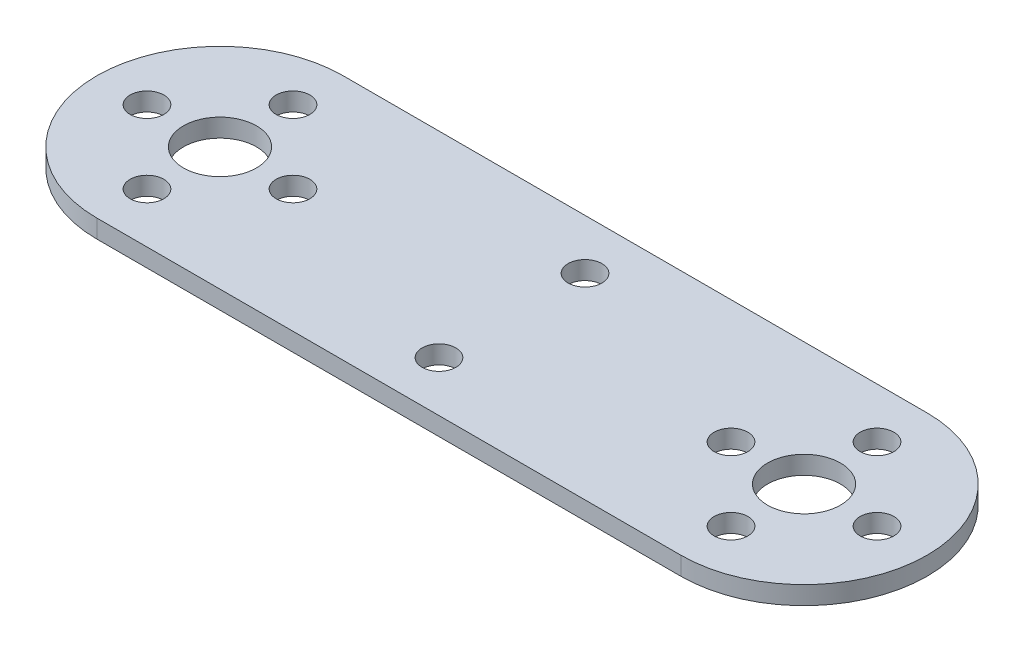
ISO-10303-21;
HEADER;
FILE_DESCRIPTION(('STEP AP214'),'2;1');
FILE_NAME('part.step','',(''),(''),'','','');
FILE_SCHEMA(('AUTOMOTIVE_DESIGN { 1 0 10303 214 1 1 1 1 }'));
ENDSEC;
DATA;
#1=APPLICATION_CONTEXT('core data for automotive mechanical design processes');
#2=APPLICATION_PROTOCOL_DEFINITION('international standard','automotive_design',2000,#1);
#3=PRODUCT_CONTEXT('',#1,'mechanical');
#4=PRODUCT('Part','Part','',(#3));
#5=PRODUCT_RELATED_PRODUCT_CATEGORY('part','',(#4));
#6=PRODUCT_DEFINITION_FORMATION('','',#4);
#7=PRODUCT_DEFINITION_CONTEXT('part definition',#1,'design');
#8=PRODUCT_DEFINITION('design','',#6,#7);
#9=PRODUCT_DEFINITION_SHAPE('','',#8);
#10=(LENGTH_UNIT() NAMED_UNIT(*) SI_UNIT(.MILLI.,.METRE.));
#11=(NAMED_UNIT(*) PLANE_ANGLE_UNIT() SI_UNIT($,.RADIAN.));
#12=(NAMED_UNIT(*) SI_UNIT($,.STERADIAN.) SOLID_ANGLE_UNIT());
#13=UNCERTAINTY_MEASURE_WITH_UNIT(LENGTH_MEASURE(1.E-05),#10,'distance_accuracy_value','');
#14=(GEOMETRIC_REPRESENTATION_CONTEXT(3) GLOBAL_UNCERTAINTY_ASSIGNED_CONTEXT((#13)) GLOBAL_UNIT_ASSIGNED_CONTEXT((#10,
#11,#12)) REPRESENTATION_CONTEXT('',''));
#15=CARTESIAN_POINT('',(0.,0.,0.));
#16=DIRECTION('',(0.,0.,1.));
#17=DIRECTION('',(1.,0.,0.));
#18=AXIS2_PLACEMENT_3D('',#15,#16,#17);
#19=CARTESIAN_POINT('',(0.,2.,0.));
#20=DIRECTION('',(0.,1.,0.));
#21=DIRECTION('',(0.,0.,1.));
#22=AXIS2_PLACEMENT_3D('',#19,#20,#21);
#23=PLANE('',#22);
#24=CARTESIAN_POINT('',(32.,2.,8.));
#25=DIRECTION('',(0.,1.,0.));
#26=DIRECTION('',(0.,0.,1.));
#27=AXIS2_PLACEMENT_3D('',#24,#25,#26);
#28=CIRCLE('',#27,1.85);
#29=CARTESIAN_POINT('',(32.,2.,9.85));
#30=VERTEX_POINT('',#29);
#31=EDGE_CURVE('E175',#30,#30,#28,.T.);
#32=ORIENTED_EDGE('',*,*,#31,.F.);
#33=EDGE_LOOP('',(#32));
#34=FACE_BOUND('',#33,.T.);
#35=CARTESIAN_POINT('',(32.,2.,-8.));
#36=DIRECTION('',(0.,1.,0.));
#37=DIRECTION('',(0.,0.,1.));
#38=AXIS2_PLACEMENT_3D('',#35,#36,#37);
#39=CIRCLE('',#38,1.85);
#40=CARTESIAN_POINT('',(32.,2.,-6.15));
#41=VERTEX_POINT('',#40);
#42=EDGE_CURVE('E169',#41,#41,#39,.T.);
#43=ORIENTED_EDGE('',*,*,#42,.F.);
#44=EDGE_LOOP('',(#43));
#45=FACE_BOUND('',#44,.T.);
#46=CARTESIAN_POINT('',(56.,2.,0.));
#47=DIRECTION('',(0.,1.,0.));
#48=DIRECTION('',(0.,0.,1.));
#49=AXIS2_PLACEMENT_3D('',#46,#47,#48);
#50=CIRCLE('',#49,1.85);
#51=CARTESIAN_POINT('',(56.,2.,1.85));
#52=VERTEX_POINT('',#51);
#53=EDGE_CURVE('E134',#52,#52,#50,.F.);
#54=ORIENTED_EDGE('',*,*,#53,.T.);
#55=EDGE_LOOP('',(#54));
#56=FACE_BOUND('',#55,.T.);
#57=CARTESIAN_POINT('',(64.,2.,8.));
#58=DIRECTION('',(0.,1.,0.));
#59=DIRECTION('',(0.,0.,1.));
#60=AXIS2_PLACEMENT_3D('',#57,#58,#59);
#61=CIRCLE('',#60,1.85);
#62=CARTESIAN_POINT('',(64.,2.,9.85));
#63=VERTEX_POINT('',#62);
#64=EDGE_CURVE('E137',#63,#63,#61,.F.);
#65=ORIENTED_EDGE('',*,*,#64,.T.);
#66=EDGE_LOOP('',(#65));
#67=FACE_BOUND('',#66,.T.);
#68=CARTESIAN_POINT('',(72.,2.,0.));
#69=DIRECTION('',(0.,1.,0.));
#70=DIRECTION('',(0.,0.,1.));
#71=AXIS2_PLACEMENT_3D('',#68,#69,#70);
#72=CIRCLE('',#71,1.85);
#73=CARTESIAN_POINT('',(72.,2.,1.85));
#74=VERTEX_POINT('',#73);
#75=EDGE_CURVE('E140',#74,#74,#72,.F.);
#76=ORIENTED_EDGE('',*,*,#75,.T.);
#77=EDGE_LOOP('',(#76));
#78=FACE_BOUND('',#77,.T.);
#79=CARTESIAN_POINT('',(64.,2.,-8.));
#80=DIRECTION('',(0.,1.,0.));
#81=DIRECTION('',(0.,0.,1.));
#82=AXIS2_PLACEMENT_3D('',#79,#80,#81);
#83=CIRCLE('',#82,1.85);
#84=CARTESIAN_POINT('',(64.,2.,-6.15));
#85=VERTEX_POINT('',#84);
#86=EDGE_CURVE('E143',#85,#85,#83,.F.);
#87=ORIENTED_EDGE('',*,*,#86,.T.);
#88=EDGE_LOOP('',(#87));
#89=FACE_BOUND('',#88,.T.);
#90=CARTESIAN_POINT('',(64.,2.,0.));
#91=DIRECTION('',(0.,1.,0.));
#92=DIRECTION('',(0.,0.,1.));
#93=AXIS2_PLACEMENT_3D('',#90,#91,#92);
#94=CIRCLE('',#93,4.);
#95=CARTESIAN_POINT('',(64.,2.,4.));
#96=VERTEX_POINT('',#95);
#97=EDGE_CURVE('E146',#96,#96,#94,.F.);
#98=ORIENTED_EDGE('',*,*,#97,.T.);
#99=EDGE_LOOP('',(#98));
#100=FACE_BOUND('',#99,.T.);
#101=CARTESIAN_POINT('',(-8.,2.,0.));
#102=DIRECTION('',(0.,1.,0.));
#103=DIRECTION('',(0.,0.,1.));
#104=AXIS2_PLACEMENT_3D('',#101,#102,#103);
#105=CIRCLE('',#104,1.85);
#106=CARTESIAN_POINT('',(-8.,2.,1.85));
#107=VERTEX_POINT('',#106);
#108=EDGE_CURVE('E149',#107,#107,#105,.F.);
#109=ORIENTED_EDGE('',*,*,#108,.T.);
#110=EDGE_LOOP('',(#109));
#111=FACE_BOUND('',#110,.T.);
#112=CARTESIAN_POINT('',(0.,2.,8.));
#113=DIRECTION('',(0.,1.,0.));
#114=DIRECTION('',(0.,0.,1.));
#115=AXIS2_PLACEMENT_3D('',#112,#113,#114);
#116=CIRCLE('',#115,1.85);
#117=CARTESIAN_POINT('',(0.,2.,9.85));
#118=VERTEX_POINT('',#117);
#119=EDGE_CURVE('E152',#118,#118,#116,.F.);
#120=ORIENTED_EDGE('',*,*,#119,.T.);
#121=EDGE_LOOP('',(#120));
#122=FACE_BOUND('',#121,.T.);
#123=CARTESIAN_POINT('',(8.,2.,0.));
#124=DIRECTION('',(0.,1.,0.));
#125=DIRECTION('',(0.,0.,1.));
#126=AXIS2_PLACEMENT_3D('',#123,#124,#125);
#127=CIRCLE('',#126,1.85);
#128=CARTESIAN_POINT('',(8.,2.,1.85));
#129=VERTEX_POINT('',#128);
#130=EDGE_CURVE('E155',#129,#129,#127,.F.);
#131=ORIENTED_EDGE('',*,*,#130,.T.);
#132=EDGE_LOOP('',(#131));
#133=FACE_BOUND('',#132,.T.);
#134=CARTESIAN_POINT('',(0.,2.,-8.));
#135=DIRECTION('',(0.,1.,0.));
#136=DIRECTION('',(0.,0.,1.));
#137=AXIS2_PLACEMENT_3D('',#134,#135,#136);
#138=CIRCLE('',#137,1.85);
#139=CARTESIAN_POINT('',(0.,2.,-6.15));
#140=VERTEX_POINT('',#139);
#141=EDGE_CURVE('E158',#140,#140,#138,.F.);
#142=ORIENTED_EDGE('',*,*,#141,.T.);
#143=EDGE_LOOP('',(#142));
#144=FACE_BOUND('',#143,.T.);
#145=CARTESIAN_POINT('',(0.,2.,0.));
#146=DIRECTION('',(0.,1.,0.));
#147=DIRECTION('',(0.,0.,1.));
#148=AXIS2_PLACEMENT_3D('',#145,#146,#147);
#149=CIRCLE('',#148,4.);
#150=CARTESIAN_POINT('',(0.,2.,4.));
#151=VERTEX_POINT('',#150);
#152=EDGE_CURVE('E161',#151,#151,#149,.F.);
#153=ORIENTED_EDGE('',*,*,#152,.T.);
#154=EDGE_LOOP('',(#153));
#155=FACE_BOUND('',#154,.T.);
#156=CARTESIAN_POINT('',(64.,2.,0.));
#157=DIRECTION('',(0.,1.,0.));
#158=DIRECTION('',(0.,0.,1.));
#159=AXIS2_PLACEMENT_3D('',#156,#157,#158);
#160=CIRCLE('',#159,13.5);
#161=CARTESIAN_POINT('',(64.,2.,-13.5));
#162=VERTEX_POINT('',#161);
#163=CARTESIAN_POINT('',(64.,2.,13.5));
#164=VERTEX_POINT('',#163);
#165=EDGE_CURVE('E40',#162,#164,#160,.F.);
#166=ORIENTED_EDGE('',*,*,#165,.F.);
#167=DIRECTION('',(-1.,0.,0.));
#168=VECTOR('',#167,1.);
#169=CARTESIAN_POINT('',(64.,2.,-13.5));
#170=LINE('',#169,#168);
#171=CARTESIAN_POINT('',(0.,2.,-13.5));
#172=VERTEX_POINT('',#171);
#173=EDGE_CURVE('E74',#172,#162,#170,.F.);
#174=ORIENTED_EDGE('',*,*,#173,.F.);
#175=CARTESIAN_POINT('',(0.,2.,0.));
#176=DIRECTION('',(0.,1.,0.));
#177=DIRECTION('',(0.,0.,1.));
#178=AXIS2_PLACEMENT_3D('',#175,#176,#177);
#179=CIRCLE('',#178,13.5);
#180=CARTESIAN_POINT('',(0.,2.,13.5));
#181=VERTEX_POINT('',#180);
#182=EDGE_CURVE('E89',#181,#172,#179,.F.);
#183=ORIENTED_EDGE('',*,*,#182,.F.);
#184=DIRECTION('',(1.,0.,0.));
#185=VECTOR('',#184,1.);
#186=CARTESIAN_POINT('',(0.,2.,13.5));
#187=LINE('',#186,#185);
#188=EDGE_CURVE('E87',#164,#181,#187,.F.);
#189=ORIENTED_EDGE('',*,*,#188,.F.);
#190=EDGE_LOOP('',(#166,#174,#183,#189));
#191=FACE_BOUND('',#190,.T.);
#192=ADVANCED_FACE('F37',(#34,#45,#56,#67,#78,#89,#100,#111,#122,#133,#144,#155,#191),#23,.T.);
#193=CARTESIAN_POINT('',(0.,0.,13.5));
#194=DIRECTION('',(0.,0.,1.));
#195=DIRECTION('',(1.,0.,0.));
#196=AXIS2_PLACEMENT_3D('',#193,#194,#195);
#197=PLANE('',#196);
#198=ORIENTED_EDGE('',*,*,#188,.T.);
#199=DIRECTION('',(0.,1.,0.));
#200=VECTOR('',#199,1.);
#201=CARTESIAN_POINT('',(0.,0.,13.5));
#202=LINE('',#201,#200);
#203=CARTESIAN_POINT('',(0.,0.,13.5));
#204=VERTEX_POINT('',#203);
#205=EDGE_CURVE('E163',#204,#181,#202,.T.);
#206=ORIENTED_EDGE('',*,*,#205,.F.);
#207=DIRECTION('',(1.,0.,0.));
#208=VECTOR('',#207,1.);
#209=CARTESIAN_POINT('',(0.,0.,13.5));
#210=LINE('',#209,#208);
#211=CARTESIAN_POINT('',(64.,0.,13.5));
#212=VERTEX_POINT('',#211);
#213=EDGE_CURVE('E97',#204,#212,#210,.T.);
#214=ORIENTED_EDGE('',*,*,#213,.T.);
#215=DIRECTION('',(0.,1.,0.));
#216=VECTOR('',#215,1.);
#217=CARTESIAN_POINT('',(64.,0.,13.5));
#218=LINE('',#217,#216);
#219=EDGE_CURVE('E83',#164,#212,#218,.F.);
#220=ORIENTED_EDGE('',*,*,#219,.F.);
#221=EDGE_LOOP('',(#198,#206,#214,#220));
#222=FACE_BOUND('',#221,.T.);
#223=ADVANCED_FACE('F96',(#222),#197,.T.);
#224=CARTESIAN_POINT('',(64.,0.,0.));
#225=DIRECTION('',(0.,1.,0.));
#226=DIRECTION('',(0.,0.,1.));
#227=AXIS2_PLACEMENT_3D('',#224,#225,#226);
#228=CYLINDRICAL_SURFACE('',#227,13.5);
#229=ORIENTED_EDGE('',*,*,#165,.T.);
#230=ORIENTED_EDGE('',*,*,#219,.T.);
#231=CARTESIAN_POINT('',(64.,0.,0.));
#232=DIRECTION('',(0.,1.,0.));
#233=DIRECTION('',(0.,0.,1.));
#234=AXIS2_PLACEMENT_3D('',#231,#232,#233);
#235=CIRCLE('',#234,13.5);
#236=CARTESIAN_POINT('',(64.,0.,-13.5));
#237=VERTEX_POINT('',#236);
#238=EDGE_CURVE('E132',#212,#237,#235,.T.);
#239=ORIENTED_EDGE('',*,*,#238,.T.);
#240=DIRECTION('',(0.,1.,0.));
#241=VECTOR('',#240,1.);
#242=CARTESIAN_POINT('',(64.,0.,-13.5));
#243=LINE('',#242,#241);
#244=EDGE_CURVE('E85',#162,#237,#243,.F.);
#245=ORIENTED_EDGE('',*,*,#244,.F.);
#246=EDGE_LOOP('',(#229,#230,#239,#245));
#247=FACE_BOUND('',#246,.T.);
#248=ADVANCED_FACE('F80',(#247),#228,.T.);
#249=CARTESIAN_POINT('',(64.,0.,-13.5));
#250=DIRECTION('',(0.,0.,-1.));
#251=DIRECTION('',(-1.,0.,0.));
#252=AXIS2_PLACEMENT_3D('',#249,#250,#251);
#253=PLANE('',#252);
#254=ORIENTED_EDGE('',*,*,#173,.T.);
#255=ORIENTED_EDGE('',*,*,#244,.T.);
#256=DIRECTION('',(1.,0.,0.));
#257=VECTOR('',#256,1.);
#258=CARTESIAN_POINT('',(0.,0.,-13.5));
#259=LINE('',#258,#257);
#260=CARTESIAN_POINT('',(0.,0.,-13.5));
#261=VERTEX_POINT('',#260);
#262=EDGE_CURVE('E131',#237,#261,#259,.F.);
#263=ORIENTED_EDGE('',*,*,#262,.T.);
#264=DIRECTION('',(0.,1.,0.));
#265=VECTOR('',#264,1.);
#266=CARTESIAN_POINT('',(0.,0.,-13.5));
#267=LINE('',#266,#265);
#268=EDGE_CURVE('E55',#172,#261,#267,.F.);
#269=ORIENTED_EDGE('',*,*,#268,.F.);
#270=EDGE_LOOP('',(#254,#255,#263,#269));
#271=FACE_BOUND('',#270,.T.);
#272=ADVANCED_FACE('F228',(#271),#253,.T.);
#273=CARTESIAN_POINT('',(0.,0.,0.));
#274=DIRECTION('',(0.,1.,0.));
#275=DIRECTION('',(0.,0.,1.));
#276=AXIS2_PLACEMENT_3D('',#273,#274,#275);
#277=CYLINDRICAL_SURFACE('',#276,13.5);
#278=ORIENTED_EDGE('',*,*,#182,.T.);
#279=ORIENTED_EDGE('',*,*,#268,.T.);
#280=CARTESIAN_POINT('',(0.,0.,0.));
#281=DIRECTION('',(0.,1.,0.));
#282=DIRECTION('',(0.,0.,1.));
#283=AXIS2_PLACEMENT_3D('',#280,#281,#282);
#284=CIRCLE('',#283,13.5);
#285=EDGE_CURVE('E129',#261,#204,#284,.T.);
#286=ORIENTED_EDGE('',*,*,#285,.T.);
#287=ORIENTED_EDGE('',*,*,#205,.T.);
#288=EDGE_LOOP('',(#278,#279,#286,#287));
#289=FACE_BOUND('',#288,.T.);
#290=ADVANCED_FACE('F218',(#289),#277,.T.);
#291=CARTESIAN_POINT('',(0.,0.,0.));
#292=DIRECTION('',(0.,1.,0.));
#293=DIRECTION('',(0.,0.,1.));
#294=AXIS2_PLACEMENT_3D('',#291,#292,#293);
#295=CYLINDRICAL_SURFACE('',#294,4.);
#296=CARTESIAN_POINT('',(0.,0.,0.));
#297=DIRECTION('',(0.,1.,0.));
#298=DIRECTION('',(0.,0.,1.));
#299=AXIS2_PLACEMENT_3D('',#296,#297,#298);
#300=CIRCLE('',#299,4.);
#301=CARTESIAN_POINT('',(0.,0.,4.));
#302=VERTEX_POINT('',#301);
#303=EDGE_CURVE('E126',#302,#302,#300,.F.);
#304=ORIENTED_EDGE('',*,*,#303,.T.);
#305=EDGE_LOOP('',(#304));
#306=FACE_BOUND('',#305,.T.);
#307=ORIENTED_EDGE('',*,*,#152,.F.);
#308=EDGE_LOOP('',(#307));
#309=FACE_BOUND('',#308,.T.);
#310=ADVANCED_FACE('F215',(#306,#309),#295,.F.);
#311=CARTESIAN_POINT('',(0.,0.,-8.));
#312=DIRECTION('',(0.,1.,0.));
#313=DIRECTION('',(0.,0.,1.));
#314=AXIS2_PLACEMENT_3D('',#311,#312,#313);
#315=CYLINDRICAL_SURFACE('',#314,1.85);
#316=CARTESIAN_POINT('',(0.,0.,-8.));
#317=DIRECTION('',(0.,1.,0.));
#318=DIRECTION('',(0.,0.,1.));
#319=AXIS2_PLACEMENT_3D('',#316,#317,#318);
#320=CIRCLE('',#319,1.85);
#321=CARTESIAN_POINT('',(0.,0.,-6.15));
#322=VERTEX_POINT('',#321);
#323=EDGE_CURVE('E123',#322,#322,#320,.F.);
#324=ORIENTED_EDGE('',*,*,#323,.T.);
#325=EDGE_LOOP('',(#324));
#326=FACE_BOUND('',#325,.T.);
#327=ORIENTED_EDGE('',*,*,#141,.F.);
#328=EDGE_LOOP('',(#327));
#329=FACE_BOUND('',#328,.T.);
#330=ADVANCED_FACE('F217',(#326,#329),#315,.F.);
#331=CARTESIAN_POINT('',(8.,0.,0.));
#332=DIRECTION('',(0.,1.,0.));
#333=DIRECTION('',(0.,0.,1.));
#334=AXIS2_PLACEMENT_3D('',#331,#332,#333);
#335=CYLINDRICAL_SURFACE('',#334,1.85);
#336=CARTESIAN_POINT('',(8.,0.,0.));
#337=DIRECTION('',(0.,1.,0.));
#338=DIRECTION('',(0.,0.,1.));
#339=AXIS2_PLACEMENT_3D('',#336,#337,#338);
#340=CIRCLE('',#339,1.85);
#341=CARTESIAN_POINT('',(8.,0.,1.85));
#342=VERTEX_POINT('',#341);
#343=EDGE_CURVE('E120',#342,#342,#340,.F.);
#344=ORIENTED_EDGE('',*,*,#343,.T.);
#345=EDGE_LOOP('',(#344));
#346=FACE_BOUND('',#345,.T.);
#347=ORIENTED_EDGE('',*,*,#130,.F.);
#348=EDGE_LOOP('',(#347));
#349=FACE_BOUND('',#348,.T.);
#350=ADVANCED_FACE('F225',(#346,#349),#335,.F.);
#351=CARTESIAN_POINT('',(0.,0.,8.));
#352=DIRECTION('',(0.,1.,0.));
#353=DIRECTION('',(0.,0.,1.));
#354=AXIS2_PLACEMENT_3D('',#351,#352,#353);
#355=CYLINDRICAL_SURFACE('',#354,1.85);
#356=CARTESIAN_POINT('',(0.,0.,8.));
#357=DIRECTION('',(0.,1.,0.));
#358=DIRECTION('',(0.,0.,1.));
#359=AXIS2_PLACEMENT_3D('',#356,#357,#358);
#360=CIRCLE('',#359,1.85);
#361=CARTESIAN_POINT('',(0.,0.,9.85));
#362=VERTEX_POINT('',#361);
#363=EDGE_CURVE('E117',#362,#362,#360,.F.);
#364=ORIENTED_EDGE('',*,*,#363,.T.);
#365=EDGE_LOOP('',(#364));
#366=FACE_BOUND('',#365,.T.);
#367=ORIENTED_EDGE('',*,*,#119,.F.);
#368=EDGE_LOOP('',(#367));
#369=FACE_BOUND('',#368,.T.);
#370=ADVANCED_FACE('F261',(#366,#369),#355,.F.);
#371=CARTESIAN_POINT('',(-8.,0.,0.));
#372=DIRECTION('',(0.,1.,0.));
#373=DIRECTION('',(0.,0.,1.));
#374=AXIS2_PLACEMENT_3D('',#371,#372,#373);
#375=CYLINDRICAL_SURFACE('',#374,1.85);
#376=CARTESIAN_POINT('',(-8.,0.,0.));
#377=DIRECTION('',(0.,1.,0.));
#378=DIRECTION('',(0.,0.,1.));
#379=AXIS2_PLACEMENT_3D('',#376,#377,#378);
#380=CIRCLE('',#379,1.85);
#381=CARTESIAN_POINT('',(-8.,0.,1.85));
#382=VERTEX_POINT('',#381);
#383=EDGE_CURVE('E114',#382,#382,#380,.F.);
#384=ORIENTED_EDGE('',*,*,#383,.T.);
#385=EDGE_LOOP('',(#384));
#386=FACE_BOUND('',#385,.T.);
#387=ORIENTED_EDGE('',*,*,#108,.F.);
#388=EDGE_LOOP('',(#387));
#389=FACE_BOUND('',#388,.T.);
#390=ADVANCED_FACE('F257',(#386,#389),#375,.F.);
#391=CARTESIAN_POINT('',(64.,0.,0.));
#392=DIRECTION('',(0.,1.,0.));
#393=DIRECTION('',(0.,0.,1.));
#394=AXIS2_PLACEMENT_3D('',#391,#392,#393);
#395=CYLINDRICAL_SURFACE('',#394,4.);
#396=ORIENTED_EDGE('',*,*,#97,.F.);
#397=EDGE_LOOP('',(#396));
#398=FACE_BOUND('',#397,.T.);
#399=CARTESIAN_POINT('',(64.,0.,0.));
#400=DIRECTION('',(0.,1.,0.));
#401=DIRECTION('',(0.,0.,1.));
#402=AXIS2_PLACEMENT_3D('',#399,#400,#401);
#403=CIRCLE('',#402,4.);
#404=CARTESIAN_POINT('',(64.,0.,4.));
#405=VERTEX_POINT('',#404);
#406=EDGE_CURVE('E111',#405,#405,#403,.F.);
#407=ORIENTED_EDGE('',*,*,#406,.T.);
#408=EDGE_LOOP('',(#407));
#409=FACE_BOUND('',#408,.T.);
#410=ADVANCED_FACE('F253',(#398,#409),#395,.F.);
#411=CARTESIAN_POINT('',(64.,0.,-8.));
#412=DIRECTION('',(0.,1.,0.));
#413=DIRECTION('',(0.,0.,1.));
#414=AXIS2_PLACEMENT_3D('',#411,#412,#413);
#415=CYLINDRICAL_SURFACE('',#414,1.85);
#416=ORIENTED_EDGE('',*,*,#86,.F.);
#417=EDGE_LOOP('',(#416));
#418=FACE_BOUND('',#417,.T.);
#419=CARTESIAN_POINT('',(64.,0.,-8.));
#420=DIRECTION('',(0.,1.,0.));
#421=DIRECTION('',(0.,0.,1.));
#422=AXIS2_PLACEMENT_3D('',#419,#420,#421);
#423=CIRCLE('',#422,1.85);
#424=CARTESIAN_POINT('',(64.,0.,-6.15));
#425=VERTEX_POINT('',#424);
#426=EDGE_CURVE('E108',#425,#425,#423,.F.);
#427=ORIENTED_EDGE('',*,*,#426,.T.);
#428=EDGE_LOOP('',(#427));
#429=FACE_BOUND('',#428,.T.);
#430=ADVANCED_FACE('F249',(#418,#429),#415,.F.);
#431=CARTESIAN_POINT('',(72.,0.,0.));
#432=DIRECTION('',(0.,1.,0.));
#433=DIRECTION('',(0.,0.,1.));
#434=AXIS2_PLACEMENT_3D('',#431,#432,#433);
#435=CYLINDRICAL_SURFACE('',#434,1.85);
#436=ORIENTED_EDGE('',*,*,#75,.F.);
#437=EDGE_LOOP('',(#436));
#438=FACE_BOUND('',#437,.T.);
#439=CARTESIAN_POINT('',(72.,0.,0.));
#440=DIRECTION('',(0.,1.,0.));
#441=DIRECTION('',(0.,0.,1.));
#442=AXIS2_PLACEMENT_3D('',#439,#440,#441);
#443=CIRCLE('',#442,1.85);
#444=CARTESIAN_POINT('',(72.,0.,1.85));
#445=VERTEX_POINT('',#444);
#446=EDGE_CURVE('E105',#445,#445,#443,.F.);
#447=ORIENTED_EDGE('',*,*,#446,.T.);
#448=EDGE_LOOP('',(#447));
#449=FACE_BOUND('',#448,.T.);
#450=ADVANCED_FACE('F245',(#438,#449),#435,.F.);
#451=CARTESIAN_POINT('',(64.,0.,8.));
#452=DIRECTION('',(0.,1.,0.));
#453=DIRECTION('',(0.,0.,1.));
#454=AXIS2_PLACEMENT_3D('',#451,#452,#453);
#455=CYLINDRICAL_SURFACE('',#454,1.85);
#456=ORIENTED_EDGE('',*,*,#64,.F.);
#457=EDGE_LOOP('',(#456));
#458=FACE_BOUND('',#457,.T.);
#459=CARTESIAN_POINT('',(64.,0.,8.));
#460=DIRECTION('',(0.,1.,0.));
#461=DIRECTION('',(0.,0.,1.));
#462=AXIS2_PLACEMENT_3D('',#459,#460,#461);
#463=CIRCLE('',#462,1.85);
#464=CARTESIAN_POINT('',(64.,0.,9.85));
#465=VERTEX_POINT('',#464);
#466=EDGE_CURVE('E46',#465,#465,#463,.F.);
#467=ORIENTED_EDGE('',*,*,#466,.T.);
#468=EDGE_LOOP('',(#467));
#469=FACE_BOUND('',#468,.T.);
#470=ADVANCED_FACE('F239',(#458,#469),#455,.F.);
#471=CARTESIAN_POINT('',(56.,0.,0.));
#472=DIRECTION('',(0.,1.,0.));
#473=DIRECTION('',(0.,0.,1.));
#474=AXIS2_PLACEMENT_3D('',#471,#472,#473);
#475=CYLINDRICAL_SURFACE('',#474,1.85);
#476=ORIENTED_EDGE('',*,*,#53,.F.);
#477=EDGE_LOOP('',(#476));
#478=FACE_BOUND('',#477,.T.);
#479=CARTESIAN_POINT('',(56.,0.,0.));
#480=DIRECTION('',(0.,1.,0.));
#481=DIRECTION('',(0.,0.,1.));
#482=AXIS2_PLACEMENT_3D('',#479,#480,#481);
#483=CIRCLE('',#482,1.85);
#484=CARTESIAN_POINT('',(56.,0.,1.85));
#485=VERTEX_POINT('',#484);
#486=EDGE_CURVE('E11',#485,#485,#483,.F.);
#487=ORIENTED_EDGE('',*,*,#486,.T.);
#488=EDGE_LOOP('',(#487));
#489=FACE_BOUND('',#488,.T.);
#490=ADVANCED_FACE('F231',(#478,#489),#475,.F.);
#491=CARTESIAN_POINT('',(0.,0.,0.));
#492=DIRECTION('',(0.,1.,0.));
#493=DIRECTION('',(0.,0.,1.));
#494=AXIS2_PLACEMENT_3D('',#491,#492,#493);
#495=PLANE('',#494);
#496=CARTESIAN_POINT('',(32.,0.,8.));
#497=DIRECTION('',(0.,1.,0.));
#498=DIRECTION('',(0.,0.,1.));
#499=AXIS2_PLACEMENT_3D('',#496,#497,#498);
#500=CIRCLE('',#499,1.85);
#501=CARTESIAN_POINT('',(32.,0.,9.85));
#502=VERTEX_POINT('',#501);
#503=EDGE_CURVE('E172',#502,#502,#500,.T.);
#504=ORIENTED_EDGE('',*,*,#503,.T.);
#505=EDGE_LOOP('',(#504));
#506=FACE_BOUND('',#505,.T.);
#507=CARTESIAN_POINT('',(32.,0.,-8.));
#508=DIRECTION('',(0.,1.,0.));
#509=DIRECTION('',(0.,0.,1.));
#510=AXIS2_PLACEMENT_3D('',#507,#508,#509);
#511=CIRCLE('',#510,1.85);
#512=CARTESIAN_POINT('',(32.,0.,-6.15));
#513=VERTEX_POINT('',#512);
#514=EDGE_CURVE('E93',#513,#513,#511,.T.);
#515=ORIENTED_EDGE('',*,*,#514,.T.);
#516=EDGE_LOOP('',(#515));
#517=FACE_BOUND('',#516,.T.);
#518=ORIENTED_EDGE('',*,*,#486,.F.);
#519=EDGE_LOOP('',(#518));
#520=FACE_BOUND('',#519,.T.);
#521=ORIENTED_EDGE('',*,*,#466,.F.);
#522=EDGE_LOOP('',(#521));
#523=FACE_BOUND('',#522,.T.);
#524=ORIENTED_EDGE('',*,*,#446,.F.);
#525=EDGE_LOOP('',(#524));
#526=FACE_BOUND('',#525,.T.);
#527=ORIENTED_EDGE('',*,*,#426,.F.);
#528=EDGE_LOOP('',(#527));
#529=FACE_BOUND('',#528,.T.);
#530=ORIENTED_EDGE('',*,*,#406,.F.);
#531=EDGE_LOOP('',(#530));
#532=FACE_BOUND('',#531,.T.);
#533=ORIENTED_EDGE('',*,*,#383,.F.);
#534=EDGE_LOOP('',(#533));
#535=FACE_BOUND('',#534,.T.);
#536=ORIENTED_EDGE('',*,*,#363,.F.);
#537=EDGE_LOOP('',(#536));
#538=FACE_BOUND('',#537,.T.);
#539=ORIENTED_EDGE('',*,*,#343,.F.);
#540=EDGE_LOOP('',(#539));
#541=FACE_BOUND('',#540,.T.);
#542=ORIENTED_EDGE('',*,*,#323,.F.);
#543=EDGE_LOOP('',(#542));
#544=FACE_BOUND('',#543,.T.);
#545=ORIENTED_EDGE('',*,*,#303,.F.);
#546=EDGE_LOOP('',(#545));
#547=FACE_BOUND('',#546,.T.);
#548=ORIENTED_EDGE('',*,*,#262,.F.);
#549=ORIENTED_EDGE('',*,*,#238,.F.);
#550=ORIENTED_EDGE('',*,*,#213,.F.);
#551=ORIENTED_EDGE('',*,*,#285,.F.);
#552=EDGE_LOOP('',(#548,#549,#550,#551));
#553=FACE_BOUND('',#552,.T.);
#554=ADVANCED_FACE('F181',(#506,#517,#520,#523,#526,#529,#532,#535,#538,#541,#544,#547,#553),
#495,.F.);
#555=CARTESIAN_POINT('',(32.,0.,-8.));
#556=DIRECTION('',(0.,1.,0.));
#557=DIRECTION('',(0.,0.,1.));
#558=AXIS2_PLACEMENT_3D('',#555,#556,#557);
#559=CYLINDRICAL_SURFACE('',#558,1.85);
#560=ORIENTED_EDGE('',*,*,#514,.F.);
#561=EDGE_LOOP('',(#560));
#562=FACE_BOUND('',#561,.T.);
#563=ORIENTED_EDGE('',*,*,#42,.T.);
#564=EDGE_LOOP('',(#563));
#565=FACE_BOUND('',#564,.T.);
#566=ADVANCED_FACE('F187',(#562,#565),#559,.F.);
#567=CARTESIAN_POINT('',(32.,0.,8.));
#568=DIRECTION('',(0.,1.,0.));
#569=DIRECTION('',(0.,0.,1.));
#570=AXIS2_PLACEMENT_3D('',#567,#568,#569);
#571=CYLINDRICAL_SURFACE('',#570,1.85);
#572=ORIENTED_EDGE('',*,*,#503,.F.);
#573=EDGE_LOOP('',(#572));
#574=FACE_BOUND('',#573,.T.);
#575=ORIENTED_EDGE('',*,*,#31,.T.);
#576=EDGE_LOOP('',(#575));
#577=FACE_BOUND('',#576,.T.);
#578=ADVANCED_FACE('F184',(#574,#577),#571,.F.);
#579=CLOSED_SHELL('',(#192,#223,#248,#272,#290,#310,#330,#350,#370,#390,#410,#430,#450,#470,
#490,#554,#566,#578));
#580=MANIFOLD_SOLID_BREP('B2',#579);
#581=ADVANCED_BREP_SHAPE_REPRESENTATION('',(#18,#580),#14);
#582=SHAPE_DEFINITION_REPRESENTATION(#9,#581);
ENDSEC;
END-ISO-10303-21;
